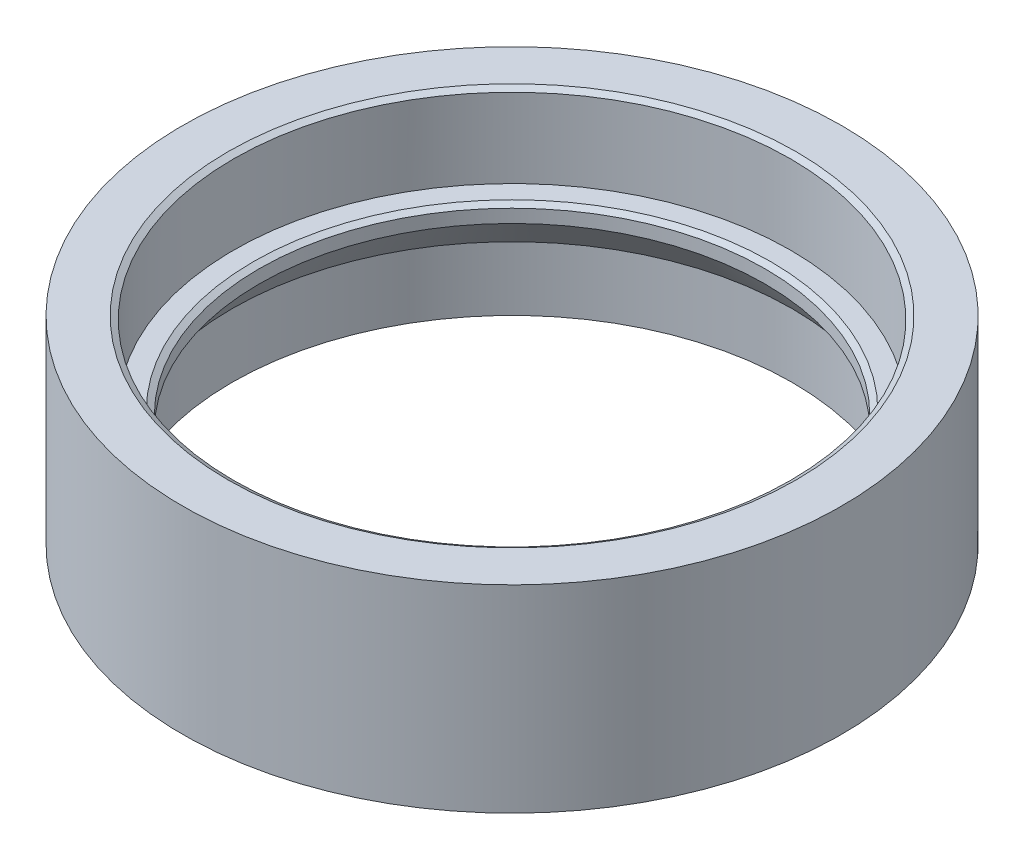
ISO-10303-21;
HEADER;
FILE_DESCRIPTION(('STEP AP214'),'2;1');
FILE_NAME('part.step','',(''),(''),'','','');
FILE_SCHEMA(('AUTOMOTIVE_DESIGN { 1 0 10303 214 1 1 1 1 }'));
ENDSEC;
DATA;
#1=APPLICATION_CONTEXT('core data for automotive mechanical design processes');
#2=APPLICATION_PROTOCOL_DEFINITION('international standard','automotive_design',2000,#1);
#3=PRODUCT_CONTEXT('',#1,'mechanical');
#4=PRODUCT('Part','Part','',(#3));
#5=PRODUCT_RELATED_PRODUCT_CATEGORY('part','',(#4));
#6=PRODUCT_DEFINITION_FORMATION('','',#4);
#7=PRODUCT_DEFINITION_CONTEXT('part definition',#1,'design');
#8=PRODUCT_DEFINITION('design','',#6,#7);
#9=PRODUCT_DEFINITION_SHAPE('','',#8);
#10=(LENGTH_UNIT() NAMED_UNIT(*) SI_UNIT(.MILLI.,.METRE.));
#11=(NAMED_UNIT(*) PLANE_ANGLE_UNIT() SI_UNIT($,.RADIAN.));
#12=(NAMED_UNIT(*) SI_UNIT($,.STERADIAN.) SOLID_ANGLE_UNIT());
#13=UNCERTAINTY_MEASURE_WITH_UNIT(LENGTH_MEASURE(1.E-05),#10,'distance_accuracy_value','');
#14=(GEOMETRIC_REPRESENTATION_CONTEXT(3) GLOBAL_UNCERTAINTY_ASSIGNED_CONTEXT((#13)) GLOBAL_UNIT_ASSIGNED_CONTEXT((#10,
#11,#12)) REPRESENTATION_CONTEXT('',''));
#15=CARTESIAN_POINT('',(0.,0.,0.));
#16=DIRECTION('',(0.,0.,1.));
#17=DIRECTION('',(1.,0.,0.));
#18=AXIS2_PLACEMENT_3D('',#15,#16,#17);
#19=CARTESIAN_POINT('',(89.9,0.,0.));
#20=DIRECTION('',(0.,-1.,0.));
#21=DIRECTION('',(0.,0.,-1.));
#22=AXIS2_PLACEMENT_3D('',#19,#20,#21);
#23=PLANE('',#22);
#24=CARTESIAN_POINT('',(0.,0.,0.));
#25=DIRECTION('',(0.,-1.,0.));
#26=DIRECTION('',(0.,0.,-1.));
#27=AXIS2_PLACEMENT_3D('',#24,#25,#26);
#28=CIRCLE('',#27,88.9);
#29=CARTESIAN_POINT('',(0.,0.,-88.9));
#30=VERTEX_POINT('',#29);
#31=EDGE_CURVE('E46',#30,#30,#28,.T.);
#32=ORIENTED_EDGE('',*,*,#31,.T.);
#33=EDGE_LOOP('',(#32));
#34=FACE_BOUND('',#33,.T.);
#35=CARTESIAN_POINT('',(0.,0.,0.));
#36=DIRECTION('',(0.,-1.,0.));
#37=DIRECTION('',(0.,0.,-1.));
#38=AXIS2_PLACEMENT_3D('',#35,#36,#37);
#39=CIRCLE('',#38,84.99);
#40=CARTESIAN_POINT('',(0.,0.,-84.99));
#41=VERTEX_POINT('',#40);
#42=EDGE_CURVE('E71',#41,#41,#39,.T.);
#43=ORIENTED_EDGE('',*,*,#42,.F.);
#44=EDGE_LOOP('',(#43));
#45=FACE_BOUND('',#44,.T.);
#46=ADVANCED_FACE('F39',(#34,#45),#23,.T.);
#47=CARTESIAN_POINT('',(0.,0.,0.));
#48=DIRECTION('',(0.,-1.,0.));
#49=DIRECTION('',(0.,0.,-1.));
#50=AXIS2_PLACEMENT_3D('',#47,#48,#49);
#51=CYLINDRICAL_SURFACE('',#50,84.99);
#52=ORIENTED_EDGE('',*,*,#42,.T.);
#53=EDGE_LOOP('',(#52));
#54=FACE_BOUND('',#53,.T.);
#55=CARTESIAN_POINT('',(0.,19.3693957972673,0.));
#56=DIRECTION('',(0.,-1.,0.));
#57=DIRECTION('',(0.,0.,-1.));
#58=AXIS2_PLACEMENT_3D('',#55,#56,#57);
#59=CIRCLE('',#58,84.99);
#60=CARTESIAN_POINT('',(0.,19.3693957972673,-84.99));
#61=VERTEX_POINT('',#60);
#62=EDGE_CURVE('E74',#61,#61,#59,.T.);
#63=ORIENTED_EDGE('',*,*,#62,.F.);
#64=EDGE_LOOP('',(#63));
#65=FACE_BOUND('',#64,.T.);
#66=ADVANCED_FACE('F115',(#54,#65),#51,.F.);
#67=CARTESIAN_POINT('',(0.,30.,0.));
#68=DIRECTION('',(0.,-1.,0.));
#69=DIRECTION('',(0.,0.,-1.));
#70=AXIS2_PLACEMENT_3D('',#67,#68,#69);
#71=CONICAL_SURFACE('',#70,76.75,0.659385391403457);
#72=ORIENTED_EDGE('',*,*,#62,.T.);
#73=EDGE_LOOP('',(#72));
#74=FACE_BOUND('',#73,.T.);
#75=CARTESIAN_POINT('',(0.,30.,0.));
#76=DIRECTION('',(0.,-1.,0.));
#77=DIRECTION('',(0.,0.,-1.));
#78=AXIS2_PLACEMENT_3D('',#75,#76,#77);
#79=CIRCLE('',#78,76.75);
#80=CARTESIAN_POINT('',(0.,30.,-76.75));
#81=VERTEX_POINT('',#80);
#82=EDGE_CURVE('E77',#81,#81,#79,.T.);
#83=ORIENTED_EDGE('',*,*,#82,.F.);
#84=EDGE_LOOP('',(#83));
#85=FACE_BOUND('',#84,.T.);
#86=ADVANCED_FACE('F122',(#74,#85),#71,.F.);
#87=CARTESIAN_POINT('',(0.,0.,0.));
#88=DIRECTION('',(0.,-1.,0.));
#89=DIRECTION('',(0.,0.,-1.));
#90=AXIS2_PLACEMENT_3D('',#87,#88,#89);
#91=CYLINDRICAL_SURFACE('',#90,76.75);
#92=CARTESIAN_POINT('',(0.,34.,0.));
#93=DIRECTION('',(0.,1.,0.));
#94=DIRECTION('',(0.,0.,1.));
#95=AXIS2_PLACEMENT_3D('',#92,#93,#94);
#96=CIRCLE('',#95,76.75);
#97=CARTESIAN_POINT('',(0.,34.,76.75));
#98=VERTEX_POINT('',#97);
#99=EDGE_CURVE('E59',#98,#98,#96,.T.);
#100=ORIENTED_EDGE('',*,*,#99,.T.);
#101=EDGE_LOOP('',(#100));
#102=FACE_BOUND('',#101,.T.);
#103=ORIENTED_EDGE('',*,*,#82,.T.);
#104=EDGE_LOOP('',(#103));
#105=FACE_BOUND('',#104,.T.);
#106=ADVANCED_FACE('F174',(#102,#105),#91,.F.);
#107=CARTESIAN_POINT('',(76.75,35.,0.));
#108=DIRECTION('',(0.,1.,0.));
#109=DIRECTION('',(0.,0.,1.));
#110=AXIS2_PLACEMENT_3D('',#107,#108,#109);
#111=PLANE('',#110);
#112=CARTESIAN_POINT('',(0.,35.,0.));
#113=DIRECTION('',(0.,1.,0.));
#114=DIRECTION('',(0.,0.,1.));
#115=AXIS2_PLACEMENT_3D('',#112,#113,#114);
#116=CIRCLE('',#115,78.4820508075688);
#117=CARTESIAN_POINT('',(0.,35.,78.4820508075688));
#118=VERTEX_POINT('',#117);
#119=EDGE_CURVE('E62',#118,#118,#116,.F.);
#120=ORIENTED_EDGE('',*,*,#119,.T.);
#121=EDGE_LOOP('',(#120));
#122=FACE_BOUND('',#121,.T.);
#123=CARTESIAN_POINT('',(0.,35.,0.));
#124=DIRECTION('',(0.,-1.,0.));
#125=DIRECTION('',(0.,0.,-1.));
#126=AXIS2_PLACEMENT_3D('',#123,#124,#125);
#127=CIRCLE('',#126,84.5);
#128=CARTESIAN_POINT('',(0.,35.,-84.5));
#129=VERTEX_POINT('',#128);
#130=EDGE_CURVE('E80',#129,#129,#127,.T.);
#131=ORIENTED_EDGE('',*,*,#130,.F.);
#132=EDGE_LOOP('',(#131));
#133=FACE_BOUND('',#132,.T.);
#134=ADVANCED_FACE('F170',(#122,#133),#111,.T.);
#135=CARTESIAN_POINT('',(0.,0.,0.));
#136=DIRECTION('',(0.,-1.,0.));
#137=DIRECTION('',(0.,0.,-1.));
#138=AXIS2_PLACEMENT_3D('',#135,#136,#137);
#139=CYLINDRICAL_SURFACE('',#138,84.5);
#140=CARTESIAN_POINT('',(0.,59.,0.));
#141=DIRECTION('',(0.,1.,0.));
#142=DIRECTION('',(0.,0.,1.));
#143=AXIS2_PLACEMENT_3D('',#140,#141,#142);
#144=CIRCLE('',#143,84.5);
#145=CARTESIAN_POINT('',(0.,59.,84.5));
#146=VERTEX_POINT('',#145);
#147=EDGE_CURVE('E65',#146,#146,#144,.T.);
#148=ORIENTED_EDGE('',*,*,#147,.T.);
#149=EDGE_LOOP('',(#148));
#150=FACE_BOUND('',#149,.T.);
#151=ORIENTED_EDGE('',*,*,#130,.T.);
#152=EDGE_LOOP('',(#151));
#153=FACE_BOUND('',#152,.T.);
#154=ADVANCED_FACE('F164',(#150,#153),#139,.F.);
#155=CARTESIAN_POINT('',(84.5,60.,0.));
#156=DIRECTION('',(0.,1.,0.));
#157=DIRECTION('',(0.,0.,1.));
#158=AXIS2_PLACEMENT_3D('',#155,#156,#157);
#159=PLANE('',#158);
#160=CARTESIAN_POINT('',(0.,60.,0.));
#161=DIRECTION('',(0.,1.,0.));
#162=DIRECTION('',(0.,0.,1.));
#163=AXIS2_PLACEMENT_3D('',#160,#161,#162);
#164=CIRCLE('',#163,86.2320508075689);
#165=CARTESIAN_POINT('',(0.,60.,86.2320508075689));
#166=VERTEX_POINT('',#165);
#167=EDGE_CURVE('E68',#166,#166,#164,.F.);
#168=ORIENTED_EDGE('',*,*,#167,.T.);
#169=EDGE_LOOP('',(#168));
#170=FACE_BOUND('',#169,.T.);
#171=CARTESIAN_POINT('',(0.,60.,0.));
#172=DIRECTION('',(0.,-1.,0.));
#173=DIRECTION('',(0.,0.,-1.));
#174=AXIS2_PLACEMENT_3D('',#171,#172,#173);
#175=CIRCLE('',#174,100.);
#176=CARTESIAN_POINT('',(0.,60.,-100.));
#177=VERTEX_POINT('',#176);
#178=EDGE_CURVE('E83',#177,#177,#175,.T.);
#179=ORIENTED_EDGE('',*,*,#178,.F.);
#180=EDGE_LOOP('',(#179));
#181=FACE_BOUND('',#180,.T.);
#182=ADVANCED_FACE('F157',(#170,#181),#159,.T.);
#183=CARTESIAN_POINT('',(0.,0.,0.));
#184=DIRECTION('',(0.,-1.,0.));
#185=DIRECTION('',(0.,0.,-1.));
#186=AXIS2_PLACEMENT_3D('',#183,#184,#185);
#187=CYLINDRICAL_SURFACE('',#186,100.);
#188=ORIENTED_EDGE('',*,*,#178,.T.);
#189=EDGE_LOOP('',(#188));
#190=FACE_BOUND('',#189,.T.);
#191=CARTESIAN_POINT('',(0.,0.,0.));
#192=DIRECTION('',(0.,-1.,0.));
#193=DIRECTION('',(0.,0.,-1.));
#194=AXIS2_PLACEMENT_3D('',#191,#192,#193);
#195=CIRCLE('',#194,100.);
#196=CARTESIAN_POINT('',(0.,0.,-100.));
#197=VERTEX_POINT('',#196);
#198=EDGE_CURVE('E86',#197,#197,#195,.T.);
#199=ORIENTED_EDGE('',*,*,#198,.F.);
#200=EDGE_LOOP('',(#199));
#201=FACE_BOUND('',#200,.T.);
#202=ADVANCED_FACE('F153',(#190,#201),#187,.T.);
#203=CARTESIAN_POINT('',(100.,0.,0.));
#204=DIRECTION('',(0.,-1.,0.));
#205=DIRECTION('',(0.,0.,-1.));
#206=AXIS2_PLACEMENT_3D('',#203,#204,#205);
#207=PLANE('',#206);
#208=CARTESIAN_POINT('',(0.,0.,0.));
#209=DIRECTION('',(0.,-1.,0.));
#210=DIRECTION('',(0.,0.,-1.));
#211=AXIS2_PLACEMENT_3D('',#208,#209,#210);
#212=CIRCLE('',#211,96.);
#213=CARTESIAN_POINT('',(0.,0.,-96.));
#214=VERTEX_POINT('',#213);
#215=EDGE_CURVE('E50',#214,#214,#212,.F.);
#216=ORIENTED_EDGE('',*,*,#215,.T.);
#217=EDGE_LOOP('',(#216));
#218=FACE_BOUND('',#217,.T.);
#219=ORIENTED_EDGE('',*,*,#198,.T.);
#220=EDGE_LOOP('',(#219));
#221=FACE_BOUND('',#220,.T.);
#222=ADVANCED_FACE('F111',(#218,#221),#207,.T.);
#223=CARTESIAN_POINT('',(0.,0.,0.));
#224=DIRECTION('',(0.,-1.,0.));
#225=DIRECTION('',(0.,0.,-1.));
#226=AXIS2_PLACEMENT_3D('',#223,#224,#225);
#227=CYLINDRICAL_SURFACE('',#226,95.);
#228=CARTESIAN_POINT('',(0.,1.,0.));
#229=DIRECTION('',(0.,-1.,0.));
#230=DIRECTION('',(0.,0.,-1.));
#231=AXIS2_PLACEMENT_3D('',#228,#229,#230);
#232=CIRCLE('',#231,95.);
#233=CARTESIAN_POINT('',(0.,1.,-95.));
#234=VERTEX_POINT('',#233);
#235=EDGE_CURVE('E54',#234,#234,#232,.T.);
#236=ORIENTED_EDGE('',*,*,#235,.T.);
#237=EDGE_LOOP('',(#236));
#238=FACE_BOUND('',#237,.T.);
#239=CARTESIAN_POINT('',(0.,5.,0.));
#240=DIRECTION('',(0.,-1.,0.));
#241=DIRECTION('',(0.,0.,-1.));
#242=AXIS2_PLACEMENT_3D('',#239,#240,#241);
#243=CIRCLE('',#242,95.);
#244=CARTESIAN_POINT('',(0.,5.,-95.));
#245=VERTEX_POINT('',#244);
#246=EDGE_CURVE('E89',#245,#245,#243,.T.);
#247=ORIENTED_EDGE('',*,*,#246,.F.);
#248=EDGE_LOOP('',(#247));
#249=FACE_BOUND('',#248,.T.);
#250=ADVANCED_FACE('F100',(#238,#249),#227,.F.);
#251=CARTESIAN_POINT('',(89.9,5.,0.));
#252=DIRECTION('',(0.,-1.,0.));
#253=DIRECTION('',(0.,0.,-1.));
#254=AXIS2_PLACEMENT_3D('',#251,#252,#253);
#255=PLANE('',#254);
#256=ORIENTED_EDGE('',*,*,#246,.T.);
#257=EDGE_LOOP('',(#256));
#258=FACE_BOUND('',#257,.T.);
#259=CARTESIAN_POINT('',(0.,5.,0.));
#260=DIRECTION('',(0.,-1.,0.));
#261=DIRECTION('',(0.,0.,-1.));
#262=AXIS2_PLACEMENT_3D('',#259,#260,#261);
#263=CIRCLE('',#262,89.9);
#264=CARTESIAN_POINT('',(0.,5.,-89.9));
#265=VERTEX_POINT('',#264);
#266=EDGE_CURVE('E92',#265,#265,#263,.T.);
#267=ORIENTED_EDGE('',*,*,#266,.F.);
#268=EDGE_LOOP('',(#267));
#269=FACE_BOUND('',#268,.T.);
#270=ADVANCED_FACE('F98',(#258,#269),#255,.T.);
#271=CARTESIAN_POINT('',(0.,0.,0.));
#272=DIRECTION('',(0.,-1.,0.));
#273=DIRECTION('',(0.,0.,-1.));
#274=AXIS2_PLACEMENT_3D('',#271,#272,#273);
#275=CYLINDRICAL_SURFACE('',#274,89.9);
#276=CARTESIAN_POINT('',(0.,0.999999999999999,0.));
#277=DIRECTION('',(0.,-1.,0.));
#278=DIRECTION('',(0.,0.,-1.));
#279=AXIS2_PLACEMENT_3D('',#276,#277,#278);
#280=CIRCLE('',#279,89.9);
#281=CARTESIAN_POINT('',(0.,0.999999999999999,-89.9));
#282=VERTEX_POINT('',#281);
#283=EDGE_CURVE('E10',#282,#282,#280,.F.);
#284=ORIENTED_EDGE('',*,*,#283,.T.);
#285=EDGE_LOOP('',(#284));
#286=FACE_BOUND('',#285,.T.);
#287=ORIENTED_EDGE('',*,*,#266,.T.);
#288=EDGE_LOOP('',(#287));
#289=FACE_BOUND('',#288,.T.);
#290=ADVANCED_FACE('F96',(#286,#289),#275,.T.);
#291=CARTESIAN_POINT('',(0.,60.,0.));
#292=DIRECTION('',(0.,1.,0.));
#293=DIRECTION('',(0.,0.,1.));
#294=AXIS2_PLACEMENT_3D('',#291,#292,#293);
#295=CONICAL_SURFACE('',#294,86.2320508075689,1.0471975511966);
#296=ORIENTED_EDGE('',*,*,#147,.F.);
#297=EDGE_LOOP('',(#296));
#298=FACE_BOUND('',#297,.T.);
#299=ORIENTED_EDGE('',*,*,#167,.F.);
#300=EDGE_LOOP('',(#299));
#301=FACE_BOUND('',#300,.T.);
#302=ADVANCED_FACE('F108',(#298,#301),#295,.F.);
#303=CARTESIAN_POINT('',(0.,35.,0.));
#304=DIRECTION('',(0.,1.,0.));
#305=DIRECTION('',(0.,0.,1.));
#306=AXIS2_PLACEMENT_3D('',#303,#304,#305);
#307=CONICAL_SURFACE('',#306,78.4820508075688,1.0471975511966);
#308=ORIENTED_EDGE('',*,*,#99,.F.);
#309=EDGE_LOOP('',(#308));
#310=FACE_BOUND('',#309,.T.);
#311=ORIENTED_EDGE('',*,*,#119,.F.);
#312=EDGE_LOOP('',(#311));
#313=FACE_BOUND('',#312,.T.);
#314=ADVANCED_FACE('F134',(#310,#313),#307,.F.);
#315=CARTESIAN_POINT('',(0.,1.,0.));
#316=DIRECTION('',(0.,-1.,0.));
#317=DIRECTION('',(0.,0.,-1.));
#318=AXIS2_PLACEMENT_3D('',#315,#316,#317);
#319=TOROIDAL_SURFACE('',#318,96.,1.);
#320=ORIENTED_EDGE('',*,*,#215,.F.);
#321=EDGE_LOOP('',(#320));
#322=FACE_BOUND('',#321,.T.);
#323=ORIENTED_EDGE('',*,*,#235,.F.);
#324=EDGE_LOOP('',(#323));
#325=FACE_BOUND('',#324,.T.);
#326=ADVANCED_FACE('F138',(#322,#325),#319,.T.);
#327=CARTESIAN_POINT('',(0.,0.999999999999999,0.));
#328=DIRECTION('',(0.,-1.,0.));
#329=DIRECTION('',(0.,0.,-1.));
#330=AXIS2_PLACEMENT_3D('',#327,#328,#329);
#331=TOROIDAL_SURFACE('',#330,88.9,1.);
#332=ORIENTED_EDGE('',*,*,#283,.F.);
#333=EDGE_LOOP('',(#332));
#334=FACE_BOUND('',#333,.T.);
#335=ORIENTED_EDGE('',*,*,#31,.F.);
#336=EDGE_LOOP('',(#335));
#337=FACE_BOUND('',#336,.T.);
#338=ADVANCED_FACE('F41',(#334,#337),#331,.T.);
#339=CLOSED_SHELL('',(#46,#66,#86,#106,#134,#154,#182,#202,#222,#250,#270,#290,#302,#314,#326,#338));
#340=MANIFOLD_SOLID_BREP('B2',#339);
#341=ADVANCED_BREP_SHAPE_REPRESENTATION('',(#18,#340),#14);
#342=SHAPE_DEFINITION_REPRESENTATION(#9,#341);
ENDSEC;
END-ISO-10303-21;
